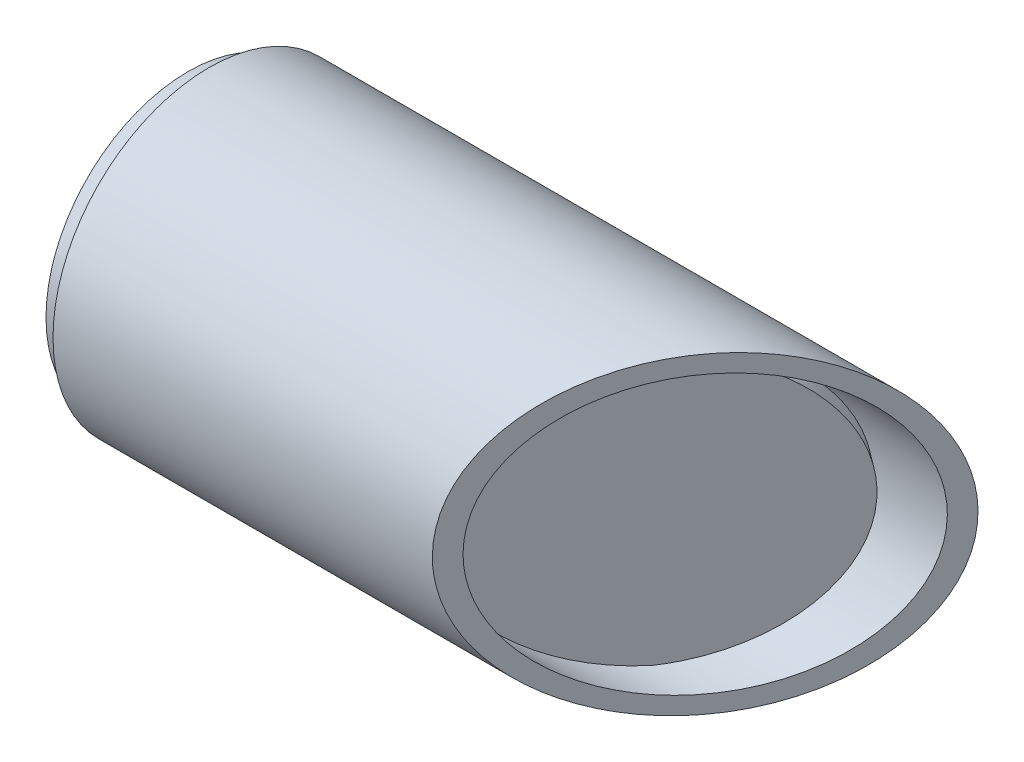
ISO-10303-21;
HEADER;
FILE_DESCRIPTION(('STEP AP214'),'2;1');
FILE_NAME('part.step','',(''),(''),'','','');
FILE_SCHEMA(('AUTOMOTIVE_DESIGN { 1 0 10303 214 1 1 1 1 }'));
ENDSEC;
DATA;
#1=APPLICATION_CONTEXT('core data for automotive mechanical design processes');
#2=APPLICATION_PROTOCOL_DEFINITION('international standard','automotive_design',2000,#1);
#3=PRODUCT_CONTEXT('',#1,'mechanical');
#4=PRODUCT('Part','Part','',(#3));
#5=PRODUCT_RELATED_PRODUCT_CATEGORY('part','',(#4));
#6=PRODUCT_DEFINITION_FORMATION('','',#4);
#7=PRODUCT_DEFINITION_CONTEXT('part definition',#1,'design');
#8=PRODUCT_DEFINITION('design','',#6,#7);
#9=PRODUCT_DEFINITION_SHAPE('','',#8);
#10=(LENGTH_UNIT() NAMED_UNIT(*) SI_UNIT(.MILLI.,.METRE.));
#11=(NAMED_UNIT(*) PLANE_ANGLE_UNIT() SI_UNIT($,.RADIAN.));
#12=(NAMED_UNIT(*) SI_UNIT($,.STERADIAN.) SOLID_ANGLE_UNIT());
#13=UNCERTAINTY_MEASURE_WITH_UNIT(LENGTH_MEASURE(1.E-05),#10,'distance_accuracy_value','');
#14=(GEOMETRIC_REPRESENTATION_CONTEXT(3) GLOBAL_UNCERTAINTY_ASSIGNED_CONTEXT((#13)) GLOBAL_UNIT_ASSIGNED_CONTEXT((#10,
#11,#12)) REPRESENTATION_CONTEXT('',''));
#15=CARTESIAN_POINT('',(0.,0.,0.));
#16=DIRECTION('',(0.,0.,1.));
#17=DIRECTION('',(1.,0.,0.));
#18=AXIS2_PLACEMENT_3D('',#15,#16,#17);
#19=CARTESIAN_POINT('',(-6.,0.,0.));
#20=DIRECTION('',(1.,0.,0.));
#21=DIRECTION('',(0.,0.,-1.));
#22=AXIS2_PLACEMENT_3D('',#19,#20,#21);
#23=CYLINDRICAL_SURFACE('',#22,40.45);
#24=CARTESIAN_POINT('',(-6.,0.,0.));
#25=DIRECTION('',(-1.,0.,0.));
#26=DIRECTION('',(0.,0.,-1.));
#27=AXIS2_PLACEMENT_3D('',#24,#25,#26);
#28=CIRCLE('',#27,40.45);
#29=CARTESIAN_POINT('',(-6.,0.,-40.45));
#30=VERTEX_POINT('',#29);
#31=EDGE_CURVE('E12',#30,#30,#28,.T.);
#32=ORIENTED_EDGE('',*,*,#31,.F.);
#33=EDGE_LOOP('',(#32));
#34=FACE_BOUND('',#33,.T.);
#35=CARTESIAN_POINT('',(0.,0.,0.));
#36=DIRECTION('',(-1.,0.,0.));
#37=DIRECTION('',(0.,0.,-1.));
#38=AXIS2_PLACEMENT_3D('',#35,#36,#37);
#39=CIRCLE('',#38,40.45);
#40=CARTESIAN_POINT('',(0.,0.,-40.45));
#41=VERTEX_POINT('',#40);
#42=EDGE_CURVE('E54',#41,#41,#39,.T.);
#43=ORIENTED_EDGE('',*,*,#42,.T.);
#44=EDGE_LOOP('',(#43));
#45=FACE_BOUND('',#44,.T.);
#46=ADVANCED_FACE('F51',(#34,#45),#23,.T.);
#47=CARTESIAN_POINT('',(-6.,0.,0.));
#48=DIRECTION('',(-1.,0.,0.));
#49=DIRECTION('',(0.,0.,1.));
#50=AXIS2_PLACEMENT_3D('',#47,#48,#49);
#51=PLANE('',#50);
#52=ORIENTED_EDGE('',*,*,#31,.T.);
#53=EDGE_LOOP('',(#52));
#54=FACE_BOUND('',#53,.T.);
#55=ADVANCED_FACE('F66',(#54),#51,.T.);
#56=CARTESIAN_POINT('',(0.,0.,0.));
#57=DIRECTION('',(-1.,0.,0.));
#58=DIRECTION('',(0.,0.,1.));
#59=AXIS2_PLACEMENT_3D('',#56,#57,#58);
#60=PLANE('',#59);
#61=ORIENTED_EDGE('',*,*,#42,.F.);
#62=EDGE_LOOP('',(#61));
#63=FACE_BOUND('',#62,.T.);
#64=ADVANCED_FACE('F64',(#63),#60,.F.);
#65=CLOSED_SHELL('',(#46,#55,#64));
#66=MANIFOLD_SOLID_BREP('B2',#65);
#67=CARTESIAN_POINT('',(123.150419999087,38.1592740287749,-1.79731130309853));
#68=CARTESIAN_POINT('',(126.852291476815,37.9291256196082,-6.74467224996873));
#69=CARTESIAN_POINT('',(130.456940295702,36.7514643224614,-11.5621001107241));
#70=CARTESIAN_POINT('',(135.433223540139,33.7255669793841,-18.2126468766536));
#71=CARTESIAN_POINT('',(137.020199169936,32.5071808376326,-20.3335582323641));
#72=CARTESIAN_POINT('',(139.257877534571,30.3863869263602,-23.324100345848));
#73=CARTESIAN_POINT('',(139.979979299406,29.6305940823055,-24.28915223717));
#74=CARTESIAN_POINT('',(141.023137186516,28.4263264493824,-25.6832791330274));
#75=CARTESIAN_POINT('',(141.36419136564,28.0131409267887,-26.1390805126039));
#76=CARTESIAN_POINT('',(142.032260390117,27.163694919624,-27.0319204238211));
#77=CARTESIAN_POINT('',(142.359684418864,26.726819442214,-27.4695058080351));
#78=CARTESIAN_POINT('',(145.222720246158,22.7182292021878,-31.2958060258204));
#79=CARTESIAN_POINT('',(147.197416431942,18.5804231607277,-33.9348859750446));
#80=CARTESIAN_POINT('',(149.873389559992,9.65940409067675,-37.5111865106633));
#81=CARTESIAN_POINT('',(150.57585839467,4.87744834060875,-38.4500000000001));
#82=CARTESIAN_POINT('',(150.57585839467,-4.87744834060942,-38.45));
#83=CARTESIAN_POINT('',(149.873389559992,-9.65940409067736,-37.5111865106631));
#84=CARTESIAN_POINT('',(147.197416431941,-18.5804231607283,-33.9348859750443));
#85=CARTESIAN_POINT('',(145.222720246158,-22.7182292021883,-31.29580602582));
#86=CARTESIAN_POINT('',(142.359684418864,-26.7268194422145,-27.4695058080347));
#87=CARTESIAN_POINT('',(142.032260390117,-27.1636949196245,-27.0319204238206));
#88=CARTESIAN_POINT('',(141.364191365639,-28.0131409267891,-26.1390805126034));
#89=CARTESIAN_POINT('',(141.023137186516,-28.4263264493829,-25.6832791330269));
#90=CARTESIAN_POINT('',(139.979979299406,-29.6305940823059,-24.2891522371695));
#91=CARTESIAN_POINT('',(139.25787753457,-30.3863869263606,-23.3241003458475));
#92=CARTESIAN_POINT('',(137.020199169935,-32.507180837633,-20.3335582323635));
#93=CARTESIAN_POINT('',(135.433223540138,-33.7255669793845,-18.2126468766531));
#94=CARTESIAN_POINT('',(130.456940295701,-36.7514643224616,-11.5621001107235));
#95=CARTESIAN_POINT('',(126.852291476814,-37.9291256196084,-6.74467224996811));
#96=CARTESIAN_POINT('',(123.150419999086,-38.159274028775,-1.79731130309788));
#97=B_SPLINE_CURVE_WITH_KNOTS('',3,(#67,#68,#69,#70,#71,#72,#73,#74,#75,#76,#77,#78,#79,#80,#81,
#82,#83,#84,#85,#86,#87,#88,#89,#90,#91,#92,#93,#94,#95,#96),.UNSPECIFIED.,.F.,.F.,(4,2,2,2,2,2,
2,2,2,2,2,2,2,2,4),(0.,0.125000000000001,0.187500000000002,0.218750000000002,0.234375000000002,
0.250000000000002,0.375000000000001,0.5,0.624999999999999,0.749999999999998,0.765624999999998,
0.781249999999998,0.812499999999999,0.874999999999999,1.),.UNSPECIFIED.);
#98=DIRECTION('',(0.800671390476921,0.,0.599103767699514));
#99=VECTOR('',#98,1.);
#100=SURFACE_OF_LINEAR_EXTRUSION('',#97,#99);
#101=CARTESIAN_POINT('',(127.954448341948,38.1592740287749,1.79731130309856));
#102=CARTESIAN_POINT('',(131.656319819676,37.9291256196082,-3.15004964377165));
#103=CARTESIAN_POINT('',(135.260968638563,36.7514643224614,-7.96747750452705));
#104=CARTESIAN_POINT('',(140.237251883,33.7255669793841,-14.6180242704566));
#105=CARTESIAN_POINT('',(141.824227512797,32.5071808376326,-16.738935626167));
#106=CARTESIAN_POINT('',(144.061905877432,30.3863869263602,-19.7294777396509));
#107=CARTESIAN_POINT('',(144.784007642268,29.6305940823055,-20.6945296309729));
#108=CARTESIAN_POINT('',(145.827165529378,28.4263264493824,-22.0886565268303));
#109=CARTESIAN_POINT('',(146.168219708501,28.0131409267887,-22.5444579064068));
#110=CARTESIAN_POINT('',(146.836288732978,27.163694919624,-23.437297817624));
#111=CARTESIAN_POINT('',(147.163712761726,26.726819442214,-23.874883201838));
#112=CARTESIAN_POINT('',(150.02674858902,22.7182292021878,-27.7011834196233));
#113=CARTESIAN_POINT('',(152.001444774803,18.5804231607277,-30.3402633688475));
#114=CARTESIAN_POINT('',(154.677417902853,9.65940409067675,-33.9165639044662));
#115=CARTESIAN_POINT('',(155.379886737532,4.87744834060875,-34.855377393803));
#116=CARTESIAN_POINT('',(155.379886737532,-4.87744834060942,-34.8553773938029));
#117=CARTESIAN_POINT('',(154.677417902853,-9.65940409067736,-33.916563904466));
#118=CARTESIAN_POINT('',(152.001444774803,-18.5804231607283,-30.3402633688472));
#119=CARTESIAN_POINT('',(150.02674858902,-22.7182292021883,-27.7011834196229));
#120=CARTESIAN_POINT('',(147.163712761726,-26.7268194422145,-23.8748832018376));
#121=CARTESIAN_POINT('',(146.836288732978,-27.1636949196245,-23.4372978176235));
#122=CARTESIAN_POINT('',(146.168219708501,-28.0131409267891,-22.5444579064064));
#123=CARTESIAN_POINT('',(145.827165529377,-28.4263264493829,-22.0886565268298));
#124=CARTESIAN_POINT('',(144.784007642267,-29.6305940823059,-20.6945296309724));
#125=CARTESIAN_POINT('',(144.061905877432,-30.3863869263606,-19.7294777396504));
#126=CARTESIAN_POINT('',(141.824227512797,-32.507180837633,-16.7389356261665));
#127=CARTESIAN_POINT('',(140.237251883,-33.7255669793845,-14.618024270456));
#128=CARTESIAN_POINT('',(135.260968638563,-36.7514643224616,-7.96747750452647));
#129=CARTESIAN_POINT('',(131.656319819676,-37.9291256196084,-3.15004964377103));
#130=CARTESIAN_POINT('',(127.954448341948,-38.159274028775,1.7973113030992));
#131=B_SPLINE_CURVE_WITH_KNOTS('',3,(#101,#102,#103,#104,#105,#106,#107,#108,#109,#110,#111,
#112,#113,#114,#115,#116,#117,#118,#119,#120,#121,#122,#123,#124,#125,#126,#127,#128,#129,#130),
.UNSPECIFIED.,.F.,.F.,(4,2,2,2,2,2,2,2,2,2,2,2,2,2,4),(0.,0.125000000000001,0.187500000000002,
0.218750000000002,0.234375000000002,0.250000000000002,0.375000000000001,0.5,0.624999999999999,
0.749999999999998,0.765624999999998,0.781249999999998,0.812499999999999,0.874999999999999,1.),.UNSPECIFIED.);
#132=CARTESIAN_POINT('',(127.954448341948,38.1592740287749,1.79731130309856));
#133=VERTEX_POINT('',#132);
#134=CARTESIAN_POINT('',(127.954448341948,-38.159274028775,1.79731130309919));
#135=VERTEX_POINT('',#134);
#136=EDGE_CURVE('E139',#133,#135,#131,.T.);
#137=ORIENTED_EDGE('',*,*,#136,.T.);
#138=CARTESIAN_POINT('',(123.150419999086,-38.1592740287749,-1.79731130309789));
#139=DIRECTION('',(0.800671390476922,0.,0.599103767699513));
#140=VECTOR('',#139,1.);
#141=LINE('',#138,#140);
#142=CARTESIAN_POINT('',(123.150419999086,-38.159274028775,-1.7973113030979));
#143=VERTEX_POINT('',#142);
#144=EDGE_CURVE('E49',#143,#135,#141,.T.);
#145=ORIENTED_EDGE('',*,*,#144,.F.);
#146=CARTESIAN_POINT('',(123.150419999086,-38.159274028775,-1.79731130309788));
#147=CARTESIAN_POINT('',(126.852291476814,-37.9291256196084,-6.74467224996811));
#148=CARTESIAN_POINT('',(130.456940295701,-36.7514643224616,-11.5621001107235));
#149=CARTESIAN_POINT('',(135.433223540138,-33.7255669793845,-18.2126468766531));
#150=CARTESIAN_POINT('',(137.020199169935,-32.507180837633,-20.3335582323635));
#151=CARTESIAN_POINT('',(139.25787753457,-30.3863869263606,-23.3241003458475));
#152=CARTESIAN_POINT('',(139.979979299406,-29.6305940823059,-24.2891522371695));
#153=CARTESIAN_POINT('',(141.023137186516,-28.4263264493829,-25.6832791330269));
#154=CARTESIAN_POINT('',(141.364191365639,-28.0131409267891,-26.1390805126034));
#155=CARTESIAN_POINT('',(142.032260390117,-27.1636949196245,-27.0319204238206));
#156=CARTESIAN_POINT('',(142.359684418864,-26.7268194422145,-27.4695058080347));
#157=CARTESIAN_POINT('',(145.222720246158,-22.7182292021883,-31.29580602582));
#158=CARTESIAN_POINT('',(147.197416431941,-18.5804231607283,-33.9348859750443));
#159=CARTESIAN_POINT('',(149.873389559992,-9.65940409067736,-37.5111865106631));
#160=CARTESIAN_POINT('',(150.57585839467,-4.87744834060942,-38.45));
#161=CARTESIAN_POINT('',(150.57585839467,4.87744834060875,-38.4500000000001));
#162=CARTESIAN_POINT('',(149.873389559992,9.65940409067675,-37.5111865106633));
#163=CARTESIAN_POINT('',(147.197416431942,18.5804231607277,-33.9348859750446));
#164=CARTESIAN_POINT('',(145.222720246158,22.7182292021878,-31.2958060258204));
#165=CARTESIAN_POINT('',(142.359684418864,26.726819442214,-27.4695058080351));
#166=CARTESIAN_POINT('',(142.032260390117,27.163694919624,-27.0319204238211));
#167=CARTESIAN_POINT('',(141.36419136564,28.0131409267887,-26.1390805126039));
#168=CARTESIAN_POINT('',(141.023137186516,28.4263264493824,-25.6832791330274));
#169=CARTESIAN_POINT('',(139.979979299406,29.6305940823055,-24.28915223717));
#170=CARTESIAN_POINT('',(139.257877534571,30.3863869263602,-23.324100345848));
#171=CARTESIAN_POINT('',(137.020199169936,32.5071808376326,-20.3335582323641));
#172=CARTESIAN_POINT('',(135.433223540139,33.7255669793841,-18.2126468766536));
#173=CARTESIAN_POINT('',(130.456940295702,36.7514643224614,-11.5621001107241));
#174=CARTESIAN_POINT('',(126.852291476815,37.9291256196082,-6.74467224996873));
#175=CARTESIAN_POINT('',(123.150419999087,38.1592740287749,-1.79731130309852));
#176=B_SPLINE_CURVE_WITH_KNOTS('',3,(#146,#147,#148,#149,#150,#151,#152,#153,#154,#155,#156,
#157,#158,#159,#160,#161,#162,#163,#164,#165,#166,#167,#168,#169,#170,#171,#172,#173,#174,#175),
.UNSPECIFIED.,.F.,.F.,(4,2,2,2,2,2,2,2,2,2,2,2,2,2,4),(0.,0.125000000000001,0.187500000000001,
0.218750000000002,0.234375000000002,0.250000000000002,0.375000000000001,0.5,0.624999999999999,
0.749999999999998,0.765624999999998,0.781249999999998,0.812499999999998,0.874999999999999,1.),.UNSPECIFIED.);
#177=CARTESIAN_POINT('',(123.150419999087,38.1592740287749,-1.79731130309853));
#178=VERTEX_POINT('',#177);
#179=EDGE_CURVE('E138',#178,#143,#176,.F.);
#180=ORIENTED_EDGE('',*,*,#179,.F.);
#181=CARTESIAN_POINT('',(123.150419999087,38.1592740287749,-1.79731130309853));
#182=DIRECTION('',(0.800671390476921,0.,0.599103767699514));
#183=VECTOR('',#182,1.);
#184=LINE('',#181,#183);
#185=EDGE_CURVE('E111',#178,#133,#184,.T.);
#186=ORIENTED_EDGE('',*,*,#185,.T.);
#187=EDGE_LOOP('',(#137,#145,#180,#186));
#188=FACE_BOUND('',#187,.T.);
#189=ADVANCED_FACE('F99',(#188),#100,.F.);
#190=CARTESIAN_POINT('',(123.150419999086,-38.1592740287749,-1.79731130309788));
#191=CARTESIAN_POINT('',(119.448548521358,-37.9291256196081,3.15004964377225));
#192=CARTESIAN_POINT('',(115.843899702471,-36.7514643224612,7.96747750452756));
#193=CARTESIAN_POINT('',(110.867616458035,-33.725566979384,14.618024270457));
#194=CARTESIAN_POINT('',(109.280640828238,-32.5071808376324,16.7389356261674));
#195=CARTESIAN_POINT('',(107.042962463603,-30.38638692636,19.7294777396512));
#196=CARTESIAN_POINT('',(106.320860698767,-29.6305940823053,20.6945296309732));
#197=CARTESIAN_POINT('',(105.277702811657,-28.4263264493822,22.0886565268306));
#198=CARTESIAN_POINT('',(104.936648632534,-28.0131409267885,22.5444579064071));
#199=CARTESIAN_POINT('',(104.268579608056,-27.1636949196238,23.4372978176242));
#200=CARTESIAN_POINT('',(103.941155579309,-26.7268194422138,23.8748832018382));
#201=CARTESIAN_POINT('',(101.078119752015,-22.7182292021877,27.7011834196234));
#202=CARTESIAN_POINT('',(99.103423566232,-18.5804231607276,30.3402633688476));
#203=CARTESIAN_POINT('',(96.4274504381817,-9.65940409067673,33.9165639044662));
#204=CARTESIAN_POINT('',(95.7249816035032,-4.87744834060902,34.8553773938029));
#205=CARTESIAN_POINT('',(95.7249816035032,4.87744834060902,34.8553773938029));
#206=CARTESIAN_POINT('',(96.4274504381819,9.65940409067728,33.916563904466));
#207=CARTESIAN_POINT('',(99.1034235662323,18.5804231607281,30.3402633688472));
#208=CARTESIAN_POINT('',(101.078119752015,22.7182292021881,27.701183419623));
#209=CARTESIAN_POINT('',(103.941155579309,26.7268194422142,23.8748832018378));
#210=CARTESIAN_POINT('',(104.268579608057,27.1636949196242,23.4372978176238));
#211=CARTESIAN_POINT('',(104.936648632534,28.0131409267889,22.5444579064066));
#212=CARTESIAN_POINT('',(105.277702811658,28.4263264493826,22.0886565268301));
#213=CARTESIAN_POINT('',(106.320860698768,29.6305940823056,20.6945296309727));
#214=CARTESIAN_POINT('',(107.042962463603,30.3863869263604,19.7294777396507));
#215=CARTESIAN_POINT('',(109.280640828238,32.5071808376327,16.7389356261668));
#216=CARTESIAN_POINT('',(110.867616458035,33.7255669793842,14.6180242704564));
#217=CARTESIAN_POINT('',(115.843899702472,36.7514643224614,7.96747750452697));
#218=CARTESIAN_POINT('',(119.448548521359,37.9291256196082,3.15004964377162));
#219=CARTESIAN_POINT('',(123.150419999087,38.1592740287749,-1.79731130309851));
#220=B_SPLINE_CURVE_WITH_KNOTS('',3,(#190,#191,#192,#193,#194,#195,#196,#197,#198,#199,#200,
#201,#202,#203,#204,#205,#206,#207,#208,#209,#210,#211,#212,#213,#214,#215,#216,#217,#218,#219),
.UNSPECIFIED.,.F.,.F.,(4,2,2,2,2,2,2,2,2,2,2,2,2,2,4),(0.,0.125000000000001,0.187500000000001,
0.218750000000001,0.234375000000001,0.250000000000001,0.375000000000001,0.500000000000001,0.625,
0.75,0.765625,0.78125,0.8125,0.875,1.),.UNSPECIFIED.);
#221=DIRECTION('',(0.800671390476921,0.,0.599103767699514));
#222=VECTOR('',#221,1.);
#223=SURFACE_OF_LINEAR_EXTRUSION('',#220,#222);
#224=CARTESIAN_POINT('',(127.954448341948,-38.1592740287749,1.7973113030992));
#225=CARTESIAN_POINT('',(124.25257686422,-37.9291256196081,6.74467224996933));
#226=CARTESIAN_POINT('',(120.647928045333,-36.7514643224612,11.5621001107246));
#227=CARTESIAN_POINT('',(115.671644800896,-33.725566979384,18.212646876654));
#228=CARTESIAN_POINT('',(114.084669171099,-32.5071808376324,20.3335582323644));
#229=CARTESIAN_POINT('',(111.846990806464,-30.38638692636,23.3241003458483));
#230=CARTESIAN_POINT('',(111.124889041629,-29.6305940823053,24.2891522371703));
#231=CARTESIAN_POINT('',(110.081731154519,-28.4263264493822,25.6832791330276));
#232=CARTESIAN_POINT('',(109.740676975395,-28.0131409267885,26.1390805126042));
#233=CARTESIAN_POINT('',(109.072607950918,-27.1636949196238,27.0319204238213));
#234=CARTESIAN_POINT('',(108.74518392217,-26.7268194422138,27.4695058080353));
#235=CARTESIAN_POINT('',(105.882148094877,-22.7182292021877,31.2958060258205));
#236=CARTESIAN_POINT('',(103.907451909094,-18.5804231607276,33.9348859750446));
#237=CARTESIAN_POINT('',(101.231478781043,-9.65940409067673,37.5111865106633));
#238=CARTESIAN_POINT('',(100.529009946365,-4.87744834060902,38.45));
#239=CARTESIAN_POINT('',(100.529009946365,4.87744834060902,38.45));
#240=CARTESIAN_POINT('',(101.231478781043,9.65940409067728,37.5111865106631));
#241=CARTESIAN_POINT('',(103.907451909094,18.5804231607281,33.9348859750443));
#242=CARTESIAN_POINT('',(105.882148094877,22.7182292021881,31.2958060258201));
#243=CARTESIAN_POINT('',(108.745183922171,26.7268194422142,27.4695058080349));
#244=CARTESIAN_POINT('',(109.072607950918,27.1636949196242,27.0319204238208));
#245=CARTESIAN_POINT('',(109.740676975396,28.0131409267889,26.1390805126037));
#246=CARTESIAN_POINT('',(110.081731154519,28.4263264493826,25.6832791330272));
#247=CARTESIAN_POINT('',(111.124889041629,29.6305940823056,24.2891522371698));
#248=CARTESIAN_POINT('',(111.846990806465,30.3863869263604,23.3241003458478));
#249=CARTESIAN_POINT('',(114.084669171099,32.5071808376327,20.3335582323639));
#250=CARTESIAN_POINT('',(115.671644800897,33.7255669793842,18.2126468766535));
#251=CARTESIAN_POINT('',(120.647928045333,36.7514643224614,11.5621001107241));
#252=CARTESIAN_POINT('',(124.25257686422,37.9291256196082,6.74467224996871));
#253=CARTESIAN_POINT('',(127.954448341948,38.1592740287749,1.79731130309857));
#254=B_SPLINE_CURVE_WITH_KNOTS('',3,(#224,#225,#226,#227,#228,#229,#230,#231,#232,#233,#234,
#235,#236,#237,#238,#239,#240,#241,#242,#243,#244,#245,#246,#247,#248,#249,#250,#251,#252,#253),
.UNSPECIFIED.,.F.,.F.,(4,2,2,2,2,2,2,2,2,2,2,2,2,2,4),(0.,0.125000000000001,0.187500000000001,
0.218750000000001,0.234375000000001,0.250000000000001,0.375000000000001,0.500000000000001,0.625,
0.75,0.765625,0.78125,0.8125,0.875,1.),.UNSPECIFIED.);
#255=EDGE_CURVE('E127',#135,#133,#254,.T.);
#256=ORIENTED_EDGE('',*,*,#255,.T.);
#257=ORIENTED_EDGE('',*,*,#185,.F.);
#258=CARTESIAN_POINT('',(123.150419999087,38.1592740287749,-1.79731130309851));
#259=CARTESIAN_POINT('',(119.448548521359,37.9291256196082,3.15004964377162));
#260=CARTESIAN_POINT('',(115.843899702472,36.7514643224614,7.96747750452697));
#261=CARTESIAN_POINT('',(110.867616458035,33.7255669793842,14.6180242704564));
#262=CARTESIAN_POINT('',(109.280640828238,32.5071808376327,16.7389356261668));
#263=CARTESIAN_POINT('',(107.042962463603,30.3863869263604,19.7294777396507));
#264=CARTESIAN_POINT('',(106.320860698768,29.6305940823056,20.6945296309727));
#265=CARTESIAN_POINT('',(105.277702811658,28.4263264493826,22.0886565268301));
#266=CARTESIAN_POINT('',(104.936648632534,28.0131409267889,22.5444579064066));
#267=CARTESIAN_POINT('',(104.268579608057,27.1636949196242,23.4372978176237));
#268=CARTESIAN_POINT('',(103.941155579309,26.7268194422142,23.8748832018378));
#269=CARTESIAN_POINT('',(101.078119752015,22.7182292021881,27.701183419623));
#270=CARTESIAN_POINT('',(99.1034235662323,18.5804231607281,30.3402633688472));
#271=CARTESIAN_POINT('',(96.4274504381819,9.65940409067728,33.916563904466));
#272=CARTESIAN_POINT('',(95.7249816035032,4.87744834060902,34.8553773938029));
#273=CARTESIAN_POINT('',(95.7249816035032,-4.87744834060902,34.8553773938029));
#274=CARTESIAN_POINT('',(96.4274504381817,-9.65940409067673,33.9165639044662));
#275=CARTESIAN_POINT('',(99.103423566232,-18.5804231607276,30.3402633688476));
#276=CARTESIAN_POINT('',(101.078119752015,-22.7182292021877,27.7011834196234));
#277=CARTESIAN_POINT('',(103.941155579309,-26.7268194422138,23.8748832018382));
#278=CARTESIAN_POINT('',(104.268579608056,-27.1636949196238,23.4372978176242));
#279=CARTESIAN_POINT('',(104.936648632534,-28.0131409267885,22.5444579064071));
#280=CARTESIAN_POINT('',(105.277702811657,-28.4263264493822,22.0886565268305));
#281=CARTESIAN_POINT('',(106.320860698767,-29.6305940823053,20.6945296309732));
#282=CARTESIAN_POINT('',(107.042962463603,-30.38638692636,19.7294777396512));
#283=CARTESIAN_POINT('',(109.280640828237,-32.5071808376324,16.7389356261674));
#284=CARTESIAN_POINT('',(110.867616458035,-33.725566979384,14.618024270457));
#285=CARTESIAN_POINT('',(115.843899702471,-36.7514643224612,7.96747750452756));
#286=CARTESIAN_POINT('',(119.448548521358,-37.9291256196081,3.15004964377224));
#287=CARTESIAN_POINT('',(123.150419999086,-38.1592740287749,-1.79731130309789));
#288=B_SPLINE_CURVE_WITH_KNOTS('',3,(#258,#259,#260,#261,#262,#263,#264,#265,#266,#267,#268,
#269,#270,#271,#272,#273,#274,#275,#276,#277,#278,#279,#280,#281,#282,#283,#284,#285,#286,#287),
.UNSPECIFIED.,.F.,.F.,(4,2,2,2,2,2,2,2,2,2,2,2,2,2,4),(0.,0.125,0.1875,0.21875,0.234375,0.25,
0.375,0.499999999999999,0.624999999999999,0.749999999999999,0.765624999999999,0.781249999999999,
0.812499999999999,0.874999999999999,1.),.UNSPECIFIED.);
#289=EDGE_CURVE('E118',#143,#178,#288,.F.);
#290=ORIENTED_EDGE('',*,*,#289,.F.);
#291=ORIENTED_EDGE('',*,*,#144,.T.);
#292=EDGE_LOOP('',(#256,#257,#290,#291));
#293=FACE_BOUND('',#292,.T.);
#294=ADVANCED_FACE('F132',(#293),#223,.F.);
#295=CARTESIAN_POINT('',(92.2870472058592,0.,39.45));
#296=DIRECTION('',(0.800671390476923,0.,0.599103767699512));
#297=DIRECTION('',(0.599103767699512,0.,-0.800671390476923));
#298=AXIS2_PLACEMENT_3D('',#295,#296,#297);
#299=PLANE('',#298);
#300=ORIENTED_EDGE('',*,*,#179,.T.);
#301=ORIENTED_EDGE('',*,*,#289,.T.);
#302=EDGE_LOOP('',(#300,#301));
#303=FACE_BOUND('',#302,.T.);
#304=ADVANCED_FACE('F166',(#303),#299,.F.);
#305=CARTESIAN_POINT('',(97.0910755487208,0.,43.0446226061971));
#306=DIRECTION('',(0.800671390476923,0.,0.599103767699512));
#307=DIRECTION('',(0.599103767699512,0.,-0.800671390476923));
#308=AXIS2_PLACEMENT_3D('',#305,#306,#307);
#309=PLANE('',#308);
#310=ORIENTED_EDGE('',*,*,#136,.F.);
#311=ORIENTED_EDGE('',*,*,#255,.F.);
#312=EDGE_LOOP('',(#310,#311));
#313=FACE_BOUND('',#312,.T.);
#314=ADVANCED_FACE('F149',(#313),#309,.T.);
#315=CLOSED_SHELL('',(#189,#294,#304,#314));
#316=MANIFOLD_SOLID_BREP('B7',#315);
#317=CARTESIAN_POINT('',(174.853515719964,0.,0.));
#318=DIRECTION('',(-1.,0.,0.));
#319=DIRECTION('',(0.,0.,1.));
#320=AXIS2_PLACEMENT_3D('',#317,#318,#319);
#321=CYLINDRICAL_SURFACE('',#320,39.45);
#322=CARTESIAN_POINT('',(141.299289666644,0.,0.));
#323=DIRECTION('',(-0.800671390476921,0.,-0.599103767699514));
#324=DIRECTION('',(-0.599103767699514,0.,0.800671390476921));
#325=AXIS2_PLACEMENT_3D('',#322,#323,#324);
#326=ELLIPSE('',#325,49.2711497740684,39.45);
#327=CARTESIAN_POINT('',(111.780758198113,0.,39.45));
#328=VERTEX_POINT('',#327);
#329=EDGE_CURVE('E98',#328,#328,#326,.T.);
#330=ORIENTED_EDGE('',*,*,#329,.F.);
#331=EDGE_LOOP('',(#330));
#332=FACE_BOUND('',#331,.T.);
#333=CARTESIAN_POINT('',(0.,0.,0.));
#334=DIRECTION('',(1.,0.,0.));
#335=DIRECTION('',(0.,0.,-1.));
#336=AXIS2_PLACEMENT_3D('',#333,#334,#335);
#337=CIRCLE('',#336,39.45);
#338=CARTESIAN_POINT('',(0.,0.,-39.45));
#339=VERTEX_POINT('',#338);
#340=EDGE_CURVE('E303',#339,#339,#337,.T.);
#341=ORIENTED_EDGE('',*,*,#340,.F.);
#342=EDGE_LOOP('',(#341));
#343=FACE_BOUND('',#342,.T.);
#344=ADVANCED_FACE('F291',(#332,#343),#321,.F.);
#345=CARTESIAN_POINT('',(174.853515719964,0.,0.));
#346=DIRECTION('',(-1.,0.,0.));
#347=DIRECTION('',(0.,0.,1.));
#348=AXIS2_PLACEMENT_3D('',#345,#346,#347);
#349=CYLINDRICAL_SURFACE('',#348,44.45);
#350=CARTESIAN_POINT('',(141.299289666644,0.,0.));
#351=DIRECTION('',(-0.800671390476921,0.,-0.599103767699514));
#352=DIRECTION('',(-0.599103767699514,0.,0.800671390476921));
#353=AXIS2_PLACEMENT_3D('',#350,#351,#352);
#354=ELLIPSE('',#353,55.5159089342799,44.45);
#355=CARTESIAN_POINT('',(108.039499456854,0.,44.45));
#356=VERTEX_POINT('',#355);
#357=EDGE_CURVE('E294',#356,#356,#354,.T.);
#358=ORIENTED_EDGE('',*,*,#357,.T.);
#359=EDGE_LOOP('',(#358));
#360=FACE_BOUND('',#359,.T.);
#361=CARTESIAN_POINT('',(0.,0.,0.));
#362=DIRECTION('',(1.,0.,0.));
#363=DIRECTION('',(0.,0.,-1.));
#364=AXIS2_PLACEMENT_3D('',#361,#362,#363);
#365=CIRCLE('',#364,44.45);
#366=CARTESIAN_POINT('',(0.,0.,-44.45));
#367=VERTEX_POINT('',#366);
#368=EDGE_CURVE('E298',#367,#367,#365,.T.);
#369=ORIENTED_EDGE('',*,*,#368,.T.);
#370=EDGE_LOOP('',(#369));
#371=FACE_BOUND('',#370,.T.);
#372=ADVANCED_FACE('F311',(#360,#371),#349,.T.);
#373=CARTESIAN_POINT('',(0.,0.,0.));
#374=DIRECTION('',(1.,0.,0.));
#375=DIRECTION('',(0.,0.,-1.));
#376=AXIS2_PLACEMENT_3D('',#373,#374,#375);
#377=PLANE('',#376);
#378=ORIENTED_EDGE('',*,*,#340,.T.);
#379=EDGE_LOOP('',(#378));
#380=FACE_BOUND('',#379,.T.);
#381=ORIENTED_EDGE('',*,*,#368,.F.);
#382=EDGE_LOOP('',(#381));
#383=FACE_BOUND('',#382,.T.);
#384=ADVANCED_FACE('F316',(#380,#383),#377,.F.);
#385=CARTESIAN_POINT('',(101.842640946475,269.200703355182,52.731782869012));
#386=DIRECTION('',(-0.800671390476921,0.,-0.599103767699514));
#387=DIRECTION('',(-0.599103767699514,0.,0.800671390476921));
#388=AXIS2_PLACEMENT_3D('',#385,#386,#387);
#389=PLANE('',#388);
#390=ORIENTED_EDGE('',*,*,#329,.T.);
#391=EDGE_LOOP('',(#390));
#392=FACE_BOUND('',#391,.T.);
#393=ORIENTED_EDGE('',*,*,#357,.F.);
#394=EDGE_LOOP('',(#393));
#395=FACE_BOUND('',#394,.T.);
#396=ADVANCED_FACE('F314',(#392,#395),#389,.F.);
#397=CLOSED_SHELL('',(#344,#372,#384,#396));
#398=MANIFOLD_SOLID_BREP('B43',#397);
#399=ADVANCED_BREP_SHAPE_REPRESENTATION('',(#18,#66,#316,#398),#14);
#400=SHAPE_DEFINITION_REPRESENTATION(#9,#399);
ENDSEC;
END-ISO-10303-21;
